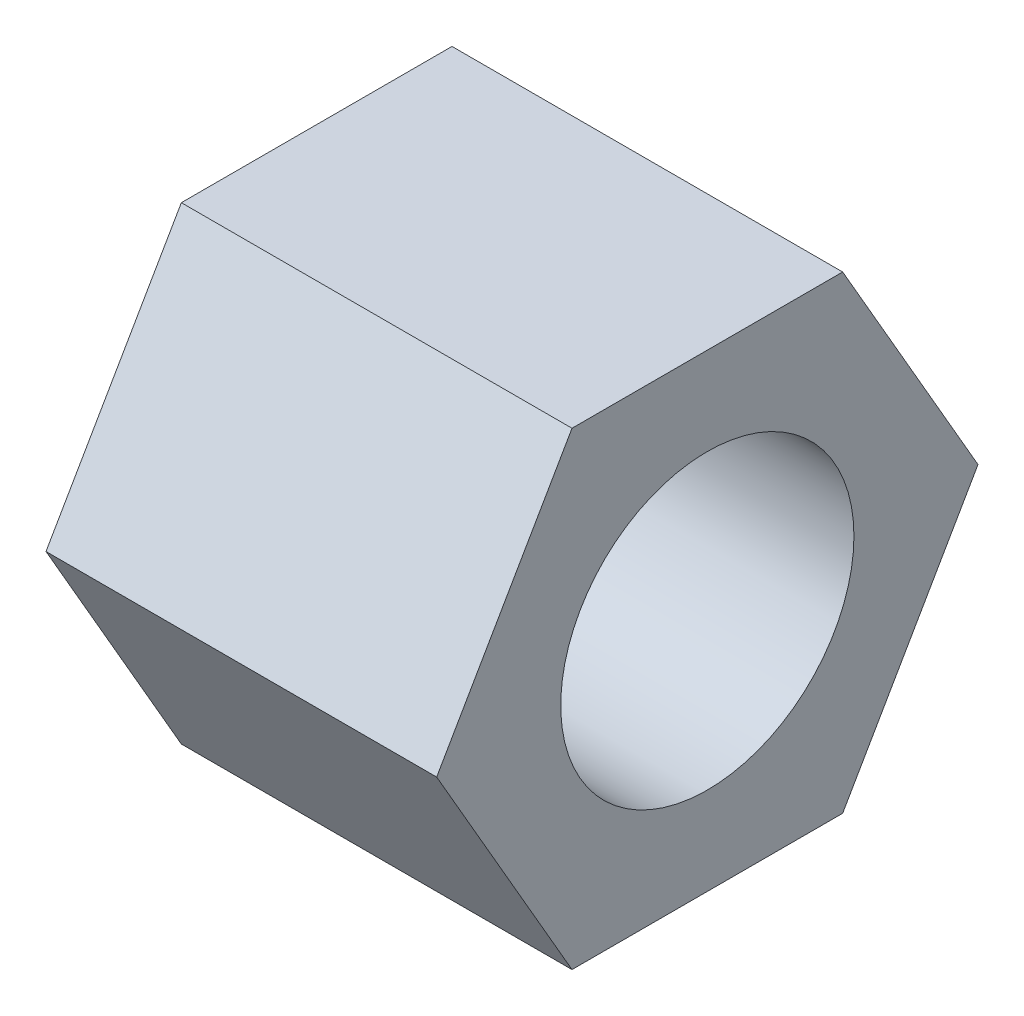
ISO-10303-21;
HEADER;
FILE_DESCRIPTION(('STEP AP214'),'2;1');
FILE_NAME('part.step','',(''),(''),'','','');
FILE_SCHEMA(('AUTOMOTIVE_DESIGN { 1 0 10303 214 1 1 1 1 }'));
ENDSEC;
DATA;
#1=APPLICATION_CONTEXT('core data for automotive mechanical design processes');
#2=APPLICATION_PROTOCOL_DEFINITION('international standard','automotive_design',2000,#1);
#3=PRODUCT_CONTEXT('',#1,'mechanical');
#4=PRODUCT('Part','Part','',(#3));
#5=PRODUCT_RELATED_PRODUCT_CATEGORY('part','',(#4));
#6=PRODUCT_DEFINITION_FORMATION('','',#4);
#7=PRODUCT_DEFINITION_CONTEXT('part definition',#1,'design');
#8=PRODUCT_DEFINITION('design','',#6,#7);
#9=PRODUCT_DEFINITION_SHAPE('','',#8);
#10=(LENGTH_UNIT() NAMED_UNIT(*) SI_UNIT(.MILLI.,.METRE.));
#11=(NAMED_UNIT(*) PLANE_ANGLE_UNIT() SI_UNIT($,.RADIAN.));
#12=(NAMED_UNIT(*) SI_UNIT($,.STERADIAN.) SOLID_ANGLE_UNIT());
#13=UNCERTAINTY_MEASURE_WITH_UNIT(LENGTH_MEASURE(1.E-05),#10,'distance_accuracy_value','');
#14=(GEOMETRIC_REPRESENTATION_CONTEXT(3) GLOBAL_UNCERTAINTY_ASSIGNED_CONTEXT((#13)) GLOBAL_UNIT_ASSIGNED_CONTEXT((#10,
#11,#12)) REPRESENTATION_CONTEXT('',''));
#15=CARTESIAN_POINT('',(0.,0.,0.));
#16=DIRECTION('',(0.,0.,1.));
#17=DIRECTION('',(1.,0.,0.));
#18=AXIS2_PLACEMENT_3D('',#15,#16,#17);
#19=CARTESIAN_POINT('',(10.,-5.99999999999996,-3.46410161513783));
#20=DIRECTION('',(0.,0.499999999999995,0.866025403784442));
#21=DIRECTION('',(0.,-0.866025403784442,0.499999999999995));
#22=AXIS2_PLACEMENT_3D('',#19,#20,#21);
#23=PLANE('',#22);
#24=DIRECTION('',(0.,0.866025403784442,-0.499999999999995));
#25=VECTOR('',#24,1.);
#26=CARTESIAN_POINT('',(0.,-5.99999999999996,-3.46410161513783));
#27=LINE('',#26,#25);
#28=CARTESIAN_POINT('',(0.,-5.99999999999996,-3.46410161513783));
#29=VERTEX_POINT('',#28);
#30=CARTESIAN_POINT('',(0.,0.,-6.92820323027551));
#31=VERTEX_POINT('',#30);
#32=EDGE_CURVE('E118',#29,#31,#27,.T.);
#33=ORIENTED_EDGE('',*,*,#32,.T.);
#34=DIRECTION('',(-1.,0.,0.));
#35=VECTOR('',#34,1.);
#36=CARTESIAN_POINT('',(10.,0.,-6.92820323027551));
#37=LINE('',#36,#35);
#38=CARTESIAN_POINT('',(10.,0.,-6.92820323027551));
#39=VERTEX_POINT('',#38);
#40=EDGE_CURVE('E11',#39,#31,#37,.T.);
#41=ORIENTED_EDGE('',*,*,#40,.F.);
#42=DIRECTION('',(0.,0.866025403784442,-0.499999999999995));
#43=VECTOR('',#42,1.);
#44=CARTESIAN_POINT('',(10.,-5.99999999999996,-3.46410161513783));
#45=LINE('',#44,#43);
#46=CARTESIAN_POINT('',(10.,-5.99999999999996,-3.46410161513783));
#47=VERTEX_POINT('',#46);
#48=EDGE_CURVE('E129',#47,#39,#45,.T.);
#49=ORIENTED_EDGE('',*,*,#48,.F.);
#50=DIRECTION('',(-1.,0.,0.));
#51=VECTOR('',#50,1.);
#52=CARTESIAN_POINT('',(10.,-5.99999999999996,-3.46410161513783));
#53=LINE('',#52,#51);
#54=EDGE_CURVE('E114',#47,#29,#53,.T.);
#55=ORIENTED_EDGE('',*,*,#54,.T.);
#56=EDGE_LOOP('',(#33,#41,#49,#55));
#57=FACE_BOUND('',#56,.T.);
#58=ADVANCED_FACE('F34',(#57),#23,.F.);
#59=CARTESIAN_POINT('',(10.,0.,-6.92820323027551));
#60=DIRECTION('',(0.,-0.500000000000001,0.866025403784438));
#61=DIRECTION('',(0.,-0.866025403784438,-0.500000000000001));
#62=AXIS2_PLACEMENT_3D('',#59,#60,#61);
#63=PLANE('',#62);
#64=DIRECTION('',(0.,0.866025403784438,0.500000000000001));
#65=VECTOR('',#64,1.);
#66=CARTESIAN_POINT('',(0.,0.,-6.92820323027551));
#67=LINE('',#66,#65);
#68=CARTESIAN_POINT('',(0.,6.00000000000001,-3.46410161513774));
#69=VERTEX_POINT('',#68);
#70=EDGE_CURVE('E121',#31,#69,#67,.T.);
#71=ORIENTED_EDGE('',*,*,#70,.T.);
#72=DIRECTION('',(-1.,0.,0.));
#73=VECTOR('',#72,1.);
#74=CARTESIAN_POINT('',(10.,6.00000000000001,-3.46410161513774));
#75=LINE('',#74,#73);
#76=CARTESIAN_POINT('',(10.,6.00000000000001,-3.46410161513774));
#77=VERTEX_POINT('',#76);
#78=EDGE_CURVE('E42',#77,#69,#75,.T.);
#79=ORIENTED_EDGE('',*,*,#78,.F.);
#80=DIRECTION('',(0.,0.866025403784438,0.500000000000001));
#81=VECTOR('',#80,1.);
#82=CARTESIAN_POINT('',(10.,0.,-6.92820323027551));
#83=LINE('',#82,#81);
#84=EDGE_CURVE('E87',#39,#77,#83,.T.);
#85=ORIENTED_EDGE('',*,*,#84,.F.);
#86=ORIENTED_EDGE('',*,*,#40,.T.);
#87=EDGE_LOOP('',(#71,#79,#85,#86));
#88=FACE_BOUND('',#87,.T.);
#89=ADVANCED_FACE('F154',(#88),#63,.F.);
#90=CARTESIAN_POINT('',(10.,6.00000000000001,-3.46410161513774));
#91=DIRECTION('',(0.,-1.,0.));
#92=DIRECTION('',(0.,0.,-1.));
#93=AXIS2_PLACEMENT_3D('',#90,#91,#92);
#94=PLANE('',#93);
#95=DIRECTION('',(0.,0.,1.));
#96=VECTOR('',#95,1.);
#97=CARTESIAN_POINT('',(0.,6.00000000000001,-3.46410161513774));
#98=LINE('',#97,#96);
#99=CARTESIAN_POINT('',(0.,5.99999999999999,3.46410161513779));
#100=VERTEX_POINT('',#99);
#101=EDGE_CURVE('E124',#69,#100,#98,.T.);
#102=ORIENTED_EDGE('',*,*,#101,.T.);
#103=DIRECTION('',(-1.,0.,0.));
#104=VECTOR('',#103,1.);
#105=CARTESIAN_POINT('',(10.,5.99999999999999,3.46410161513779));
#106=LINE('',#105,#104);
#107=CARTESIAN_POINT('',(10.,5.99999999999999,3.46410161513779));
#108=VERTEX_POINT('',#107);
#109=EDGE_CURVE('E109',#108,#100,#106,.T.);
#110=ORIENTED_EDGE('',*,*,#109,.F.);
#111=DIRECTION('',(0.,0.,1.));
#112=VECTOR('',#111,1.);
#113=CARTESIAN_POINT('',(10.,6.00000000000001,-3.46410161513774));
#114=LINE('',#113,#112);
#115=EDGE_CURVE('E100',#77,#108,#114,.T.);
#116=ORIENTED_EDGE('',*,*,#115,.F.);
#117=ORIENTED_EDGE('',*,*,#78,.T.);
#118=EDGE_LOOP('',(#102,#110,#116,#117));
#119=FACE_BOUND('',#118,.T.);
#120=ADVANCED_FACE('F135',(#119),#94,.F.);
#121=CARTESIAN_POINT('',(10.,5.99999999999999,3.46410161513779));
#122=DIRECTION('',(0.,-0.499999999999995,-0.866025403784442));
#123=DIRECTION('',(0.,0.866025403784442,-0.499999999999995));
#124=AXIS2_PLACEMENT_3D('',#121,#122,#123);
#125=PLANE('',#124);
#126=DIRECTION('',(0.,-0.866025403784441,0.499999999999995));
#127=VECTOR('',#126,1.);
#128=CARTESIAN_POINT('',(0.,5.99999999999999,3.46410161513779));
#129=LINE('',#128,#127);
#130=CARTESIAN_POINT('',(0.,0.,6.92820323027551));
#131=VERTEX_POINT('',#130);
#132=EDGE_CURVE('E108',#100,#131,#129,.T.);
#133=ORIENTED_EDGE('',*,*,#132,.T.);
#134=DIRECTION('',(-1.,0.,0.));
#135=VECTOR('',#134,1.);
#136=CARTESIAN_POINT('',(10.,0.,6.92820323027551));
#137=LINE('',#136,#135);
#138=CARTESIAN_POINT('',(10.,0.,6.92820323027551));
#139=VERTEX_POINT('',#138);
#140=EDGE_CURVE('E105',#139,#131,#137,.T.);
#141=ORIENTED_EDGE('',*,*,#140,.F.);
#142=DIRECTION('',(0.,-0.866025403784441,0.499999999999995));
#143=VECTOR('',#142,1.);
#144=CARTESIAN_POINT('',(10.,5.99999999999999,3.46410161513779));
#145=LINE('',#144,#143);
#146=EDGE_CURVE('E94',#108,#139,#145,.T.);
#147=ORIENTED_EDGE('',*,*,#146,.F.);
#148=ORIENTED_EDGE('',*,*,#109,.T.);
#149=EDGE_LOOP('',(#133,#141,#147,#148));
#150=FACE_BOUND('',#149,.T.);
#151=ADVANCED_FACE('F106',(#150),#125,.F.);
#152=CARTESIAN_POINT('',(10.,0.,6.92820323027551));
#153=DIRECTION('',(0.,0.500000000000007,-0.866025403784435));
#154=DIRECTION('',(0.,0.866025403784435,0.500000000000007));
#155=AXIS2_PLACEMENT_3D('',#152,#153,#154);
#156=PLANE('',#155);
#157=DIRECTION('',(0.,-0.866025403784434,-0.500000000000007));
#158=VECTOR('',#157,1.);
#159=CARTESIAN_POINT('',(0.,0.,6.92820323027551));
#160=LINE('',#159,#158);
#161=CARTESIAN_POINT('',(0.,-6.00000000000004,3.4641016151377));
#162=VERTEX_POINT('',#161);
#163=EDGE_CURVE('E73',#131,#162,#160,.T.);
#164=ORIENTED_EDGE('',*,*,#163,.T.);
#165=DIRECTION('',(-1.,0.,0.));
#166=VECTOR('',#165,1.);
#167=CARTESIAN_POINT('',(10.,-6.00000000000004,3.4641016151377));
#168=LINE('',#167,#166);
#169=CARTESIAN_POINT('',(10.,-6.00000000000004,3.4641016151377));
#170=VERTEX_POINT('',#169);
#171=EDGE_CURVE('E110',#170,#162,#168,.T.);
#172=ORIENTED_EDGE('',*,*,#171,.F.);
#173=DIRECTION('',(0.,-0.866025403784434,-0.500000000000007));
#174=VECTOR('',#173,1.);
#175=CARTESIAN_POINT('',(10.,0.,6.92820323027551));
#176=LINE('',#175,#174);
#177=EDGE_CURVE('E98',#139,#170,#176,.T.);
#178=ORIENTED_EDGE('',*,*,#177,.F.);
#179=ORIENTED_EDGE('',*,*,#140,.T.);
#180=EDGE_LOOP('',(#164,#172,#178,#179));
#181=FACE_BOUND('',#180,.T.);
#182=ADVANCED_FACE('F112',(#181),#156,.F.);
#183=CARTESIAN_POINT('',(10.,-6.00000000000004,3.4641016151377));
#184=DIRECTION('',(0.,1.,0.));
#185=DIRECTION('',(0.,0.,1.));
#186=AXIS2_PLACEMENT_3D('',#183,#184,#185);
#187=PLANE('',#186);
#188=DIRECTION('',(0.,0.,-1.));
#189=VECTOR('',#188,1.);
#190=CARTESIAN_POINT('',(0.,-6.00000000000004,3.4641016151377));
#191=LINE('',#190,#189);
#192=EDGE_CURVE('E79',#162,#29,#191,.T.);
#193=ORIENTED_EDGE('',*,*,#192,.T.);
#194=ORIENTED_EDGE('',*,*,#54,.F.);
#195=DIRECTION('',(0.,0.,-1.));
#196=VECTOR('',#195,1.);
#197=CARTESIAN_POINT('',(10.,-6.00000000000004,3.4641016151377));
#198=LINE('',#197,#196);
#199=EDGE_CURVE('E50',#170,#47,#198,.T.);
#200=ORIENTED_EDGE('',*,*,#199,.F.);
#201=ORIENTED_EDGE('',*,*,#171,.T.);
#202=EDGE_LOOP('',(#193,#194,#200,#201));
#203=FACE_BOUND('',#202,.T.);
#204=ADVANCED_FACE('F142',(#203),#187,.F.);
#205=CARTESIAN_POINT('',(10.,0.,0.));
#206=DIRECTION('',(1.,0.,0.));
#207=DIRECTION('',(0.,0.,-1.));
#208=AXIS2_PLACEMENT_3D('',#205,#206,#207);
#209=PLANE('',#208);
#210=CARTESIAN_POINT('',(10.,0.,0.));
#211=DIRECTION('',(1.,0.,0.));
#212=DIRECTION('',(0.,0.,-1.));
#213=AXIS2_PLACEMENT_3D('',#210,#211,#212);
#214=CIRCLE('',#213,3.75277674973257);
#215=CARTESIAN_POINT('',(10.,0.,-3.75277674973257));
#216=VERTEX_POINT('',#215);
#217=EDGE_CURVE('E231',#216,#216,#214,.T.);
#218=ORIENTED_EDGE('',*,*,#217,.F.);
#219=EDGE_LOOP('',(#218));
#220=FACE_BOUND('',#219,.T.);
#221=ORIENTED_EDGE('',*,*,#48,.T.);
#222=ORIENTED_EDGE('',*,*,#84,.T.);
#223=ORIENTED_EDGE('',*,*,#115,.T.);
#224=ORIENTED_EDGE('',*,*,#146,.T.);
#225=ORIENTED_EDGE('',*,*,#177,.T.);
#226=ORIENTED_EDGE('',*,*,#199,.T.);
#227=EDGE_LOOP('',(#221,#222,#223,#224,#225,#226));
#228=FACE_BOUND('',#227,.T.);
#229=ADVANCED_FACE('F96',(#220,#228),#209,.T.);
#230=CARTESIAN_POINT('',(0.,0.,0.));
#231=DIRECTION('',(1.,0.,0.));
#232=DIRECTION('',(0.,0.,-1.));
#233=AXIS2_PLACEMENT_3D('',#230,#231,#232);
#234=PLANE('',#233);
#235=CARTESIAN_POINT('',(0.,0.,0.));
#236=DIRECTION('',(1.,0.,0.));
#237=DIRECTION('',(0.,0.,-1.));
#238=AXIS2_PLACEMENT_3D('',#235,#236,#237);
#239=CIRCLE('',#238,1.5);
#240=CARTESIAN_POINT('',(0.,0.,-1.5));
#241=VERTEX_POINT('',#240);
#242=EDGE_CURVE('E230',#241,#241,#239,.T.);
#243=ORIENTED_EDGE('',*,*,#242,.T.);
#244=EDGE_LOOP('',(#243));
#245=FACE_BOUND('',#244,.T.);
#246=ORIENTED_EDGE('',*,*,#32,.F.);
#247=ORIENTED_EDGE('',*,*,#192,.F.);
#248=ORIENTED_EDGE('',*,*,#163,.F.);
#249=ORIENTED_EDGE('',*,*,#132,.F.);
#250=ORIENTED_EDGE('',*,*,#101,.F.);
#251=ORIENTED_EDGE('',*,*,#70,.F.);
#252=EDGE_LOOP('',(#246,#247,#248,#249,#250,#251));
#253=FACE_BOUND('',#252,.T.);
#254=ADVANCED_FACE('F138',(#245,#253),#234,.F.);
#255=CARTESIAN_POINT('',(2.,0.,0.));
#256=DIRECTION('',(1.,0.,0.));
#257=DIRECTION('',(0.,0.,-1.));
#258=AXIS2_PLACEMENT_3D('',#255,#256,#257);
#259=CYLINDRICAL_SURFACE('',#258,3.75277674973257);
#260=CARTESIAN_POINT('',(2.,0.,0.));
#261=DIRECTION('',(1.,0.,0.));
#262=DIRECTION('',(0.,0.,-1.));
#263=AXIS2_PLACEMENT_3D('',#260,#261,#262);
#264=CIRCLE('',#263,3.75277674973257);
#265=CARTESIAN_POINT('',(2.,0.,-3.75277674973257));
#266=VERTEX_POINT('',#265);
#267=EDGE_CURVE('E122',#266,#266,#264,.T.);
#268=ORIENTED_EDGE('',*,*,#267,.F.);
#269=EDGE_LOOP('',(#268));
#270=FACE_BOUND('',#269,.T.);
#271=ORIENTED_EDGE('',*,*,#217,.T.);
#272=EDGE_LOOP('',(#271));
#273=FACE_BOUND('',#272,.T.);
#274=ADVANCED_FACE('F189',(#270,#273),#259,.F.);
#275=CARTESIAN_POINT('',(2.,0.,0.));
#276=DIRECTION('',(1.,0.,0.));
#277=DIRECTION('',(0.,0.,-1.));
#278=AXIS2_PLACEMENT_3D('',#275,#276,#277);
#279=PLANE('',#278);
#280=CARTESIAN_POINT('',(2.,0.,0.));
#281=DIRECTION('',(1.,0.,0.));
#282=DIRECTION('',(0.,0.,-1.));
#283=AXIS2_PLACEMENT_3D('',#280,#281,#282);
#284=CIRCLE('',#283,1.5);
#285=CARTESIAN_POINT('',(2.,0.,-1.5));
#286=VERTEX_POINT('',#285);
#287=EDGE_CURVE('E227',#286,#286,#284,.T.);
#288=ORIENTED_EDGE('',*,*,#287,.F.);
#289=EDGE_LOOP('',(#288));
#290=FACE_BOUND('',#289,.T.);
#291=ORIENTED_EDGE('',*,*,#267,.T.);
#292=EDGE_LOOP('',(#291));
#293=FACE_BOUND('',#292,.T.);
#294=ADVANCED_FACE('F194',(#290,#293),#279,.T.);
#295=CARTESIAN_POINT('',(-5.,0.,0.));
#296=DIRECTION('',(1.,0.,0.));
#297=DIRECTION('',(0.,0.,-1.));
#298=AXIS2_PLACEMENT_3D('',#295,#296,#297);
#299=CYLINDRICAL_SURFACE('',#298,1.5);
#300=ORIENTED_EDGE('',*,*,#287,.T.);
#301=EDGE_LOOP('',(#300));
#302=FACE_BOUND('',#301,.T.);
#303=ORIENTED_EDGE('',*,*,#242,.F.);
#304=EDGE_LOOP('',(#303));
#305=FACE_BOUND('',#304,.T.);
#306=ADVANCED_FACE('F210',(#302,#305),#299,.F.);
#307=CLOSED_SHELL('',(#58,#89,#120,#151,#182,#204,#229,#254,#274,#294,#306));
#308=MANIFOLD_SOLID_BREP('B2',#307);
#309=ADVANCED_BREP_SHAPE_REPRESENTATION('',(#18,#308),#14);
#310=SHAPE_DEFINITION_REPRESENTATION(#9,#309);
ENDSEC;
END-ISO-10303-21;
